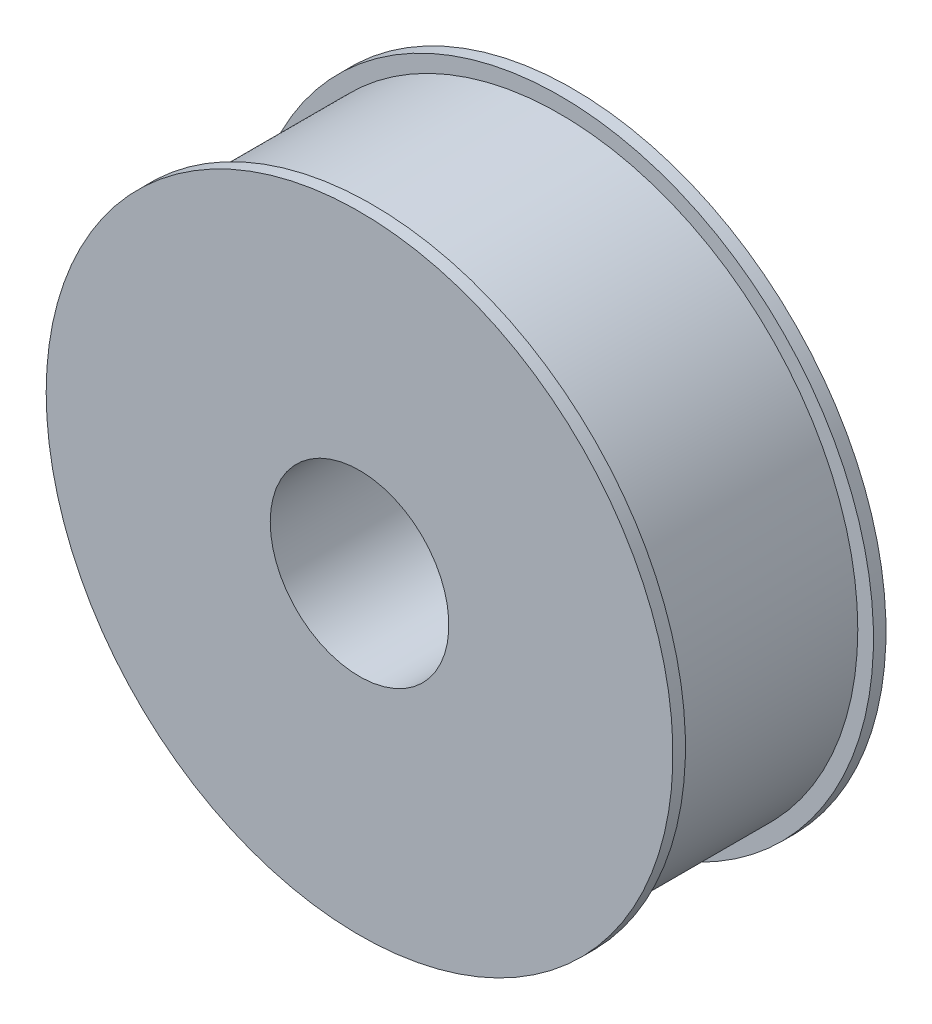
ISO-10303-21;
HEADER;
FILE_DESCRIPTION(('STEP AP214'),'2;1');
FILE_NAME('part.step','',(''),(''),'','','');
FILE_SCHEMA(('AUTOMOTIVE_DESIGN { 1 0 10303 214 1 1 1 1 }'));
ENDSEC;
DATA;
#1=APPLICATION_CONTEXT('core data for automotive mechanical design processes');
#2=APPLICATION_PROTOCOL_DEFINITION('international standard','automotive_design',2000,#1);
#3=PRODUCT_CONTEXT('',#1,'mechanical');
#4=PRODUCT('Part','Part','',(#3));
#5=PRODUCT_RELATED_PRODUCT_CATEGORY('part','',(#4));
#6=PRODUCT_DEFINITION_FORMATION('','',#4);
#7=PRODUCT_DEFINITION_CONTEXT('part definition',#1,'design');
#8=PRODUCT_DEFINITION('design','',#6,#7);
#9=PRODUCT_DEFINITION_SHAPE('','',#8);
#10=(LENGTH_UNIT() NAMED_UNIT(*) SI_UNIT(.MILLI.,.METRE.));
#11=(NAMED_UNIT(*) PLANE_ANGLE_UNIT() SI_UNIT($,.RADIAN.));
#12=(NAMED_UNIT(*) SI_UNIT($,.STERADIAN.) SOLID_ANGLE_UNIT());
#13=UNCERTAINTY_MEASURE_WITH_UNIT(LENGTH_MEASURE(1.E-05),#10,'distance_accuracy_value','');
#14=(GEOMETRIC_REPRESENTATION_CONTEXT(3) GLOBAL_UNCERTAINTY_ASSIGNED_CONTEXT((#13)) GLOBAL_UNIT_ASSIGNED_CONTEXT((#10,
#11,#12)) REPRESENTATION_CONTEXT('',''));
#15=CARTESIAN_POINT('',(0.,0.,0.));
#16=DIRECTION('',(0.,0.,1.));
#17=DIRECTION('',(1.,0.,0.));
#18=AXIS2_PLACEMENT_3D('',#15,#16,#17);
#19=CARTESIAN_POINT('',(100.,0.,34.));
#20=DIRECTION('',(0.,0.,1.));
#21=DIRECTION('',(1.,0.,0.));
#22=AXIS2_PLACEMENT_3D('',#19,#20,#21);
#23=PLANE('',#22);
#24=CARTESIAN_POINT('',(0.,0.,34.));
#25=DIRECTION('',(0.,0.,-1.));
#26=DIRECTION('',(-1.,0.,0.));
#27=AXIS2_PLACEMENT_3D('',#24,#25,#26);
#28=CIRCLE('',#27,28.5);
#29=CARTESIAN_POINT('',(-28.5,0.,34.));
#30=VERTEX_POINT('',#29);
#31=EDGE_CURVE('E10',#30,#30,#28,.T.);
#32=ORIENTED_EDGE('',*,*,#31,.T.);
#33=EDGE_LOOP('',(#32));
#34=FACE_BOUND('',#33,.T.);
#35=CARTESIAN_POINT('',(0.,0.,34.));
#36=DIRECTION('',(0.,0.,-1.));
#37=DIRECTION('',(-1.,0.,0.));
#38=AXIS2_PLACEMENT_3D('',#35,#36,#37);
#39=CIRCLE('',#38,100.);
#40=CARTESIAN_POINT('',(-100.,0.,34.));
#41=VERTEX_POINT('',#40);
#42=EDGE_CURVE('E63',#41,#41,#39,.T.);
#43=ORIENTED_EDGE('',*,*,#42,.F.);
#44=EDGE_LOOP('',(#43));
#45=FACE_BOUND('',#44,.T.);
#46=ADVANCED_FACE('F35',(#34,#45),#23,.T.);
#47=CARTESIAN_POINT('',(0.,0.,34.));
#48=DIRECTION('',(0.,0.,-1.));
#49=DIRECTION('',(-1.,0.,0.));
#50=AXIS2_PLACEMENT_3D('',#47,#48,#49);
#51=CYLINDRICAL_SURFACE('',#50,28.5);
#52=CARTESIAN_POINT('',(0.,0.,-34.));
#53=DIRECTION('',(0.,0.,-1.));
#54=DIRECTION('',(-1.,0.,0.));
#55=AXIS2_PLACEMENT_3D('',#52,#53,#54);
#56=CIRCLE('',#55,28.5);
#57=CARTESIAN_POINT('',(-28.5,0.,-34.));
#58=VERTEX_POINT('',#57);
#59=EDGE_CURVE('E41',#58,#58,#56,.T.);
#60=ORIENTED_EDGE('',*,*,#59,.T.);
#61=EDGE_LOOP('',(#60));
#62=FACE_BOUND('',#61,.T.);
#63=ORIENTED_EDGE('',*,*,#31,.F.);
#64=EDGE_LOOP('',(#63));
#65=FACE_BOUND('',#64,.T.);
#66=ADVANCED_FACE('F71',(#62,#65),#51,.F.);
#67=CARTESIAN_POINT('',(28.5,0.,-34.));
#68=DIRECTION('',(0.,0.,-1.));
#69=DIRECTION('',(-1.,0.,0.));
#70=AXIS2_PLACEMENT_3D('',#67,#68,#69);
#71=PLANE('',#70);
#72=CARTESIAN_POINT('',(0.,0.,-34.));
#73=DIRECTION('',(0.,0.,-1.));
#74=DIRECTION('',(-1.,0.,0.));
#75=AXIS2_PLACEMENT_3D('',#72,#73,#74);
#76=CIRCLE('',#75,100.);
#77=CARTESIAN_POINT('',(-100.,0.,-34.));
#78=VERTEX_POINT('',#77);
#79=EDGE_CURVE('E45',#78,#78,#76,.T.);
#80=ORIENTED_EDGE('',*,*,#79,.T.);
#81=EDGE_LOOP('',(#80));
#82=FACE_BOUND('',#81,.T.);
#83=ORIENTED_EDGE('',*,*,#59,.F.);
#84=EDGE_LOOP('',(#83));
#85=FACE_BOUND('',#84,.T.);
#86=ADVANCED_FACE('F75',(#82,#85),#71,.T.);
#87=CARTESIAN_POINT('',(0.,0.,34.));
#88=DIRECTION('',(0.,0.,-1.));
#89=DIRECTION('',(-1.,0.,0.));
#90=AXIS2_PLACEMENT_3D('',#87,#88,#89);
#91=CYLINDRICAL_SURFACE('',#90,100.);
#92=CARTESIAN_POINT('',(0.,0.,-30.));
#93=DIRECTION('',(0.,0.,-1.));
#94=DIRECTION('',(-1.,0.,0.));
#95=AXIS2_PLACEMENT_3D('',#92,#93,#94);
#96=CIRCLE('',#95,100.);
#97=CARTESIAN_POINT('',(-100.,0.,-30.));
#98=VERTEX_POINT('',#97);
#99=EDGE_CURVE('E49',#98,#98,#96,.T.);
#100=ORIENTED_EDGE('',*,*,#99,.T.);
#101=EDGE_LOOP('',(#100));
#102=FACE_BOUND('',#101,.T.);
#103=ORIENTED_EDGE('',*,*,#79,.F.);
#104=EDGE_LOOP('',(#103));
#105=FACE_BOUND('',#104,.T.);
#106=ADVANCED_FACE('F79',(#102,#105),#91,.T.);
#107=CARTESIAN_POINT('',(100.,0.,-30.));
#108=DIRECTION('',(0.,0.,1.));
#109=DIRECTION('',(1.,0.,0.));
#110=AXIS2_PLACEMENT_3D('',#107,#108,#109);
#111=PLANE('',#110);
#112=CARTESIAN_POINT('',(0.,0.,-30.));
#113=DIRECTION('',(0.,0.,-1.));
#114=DIRECTION('',(-1.,0.,0.));
#115=AXIS2_PLACEMENT_3D('',#112,#113,#114);
#116=CIRCLE('',#115,95.);
#117=CARTESIAN_POINT('',(-95.,0.,-30.));
#118=VERTEX_POINT('',#117);
#119=EDGE_CURVE('E54',#118,#118,#116,.T.);
#120=ORIENTED_EDGE('',*,*,#119,.T.);
#121=EDGE_LOOP('',(#120));
#122=FACE_BOUND('',#121,.T.);
#123=ORIENTED_EDGE('',*,*,#99,.F.);
#124=EDGE_LOOP('',(#123));
#125=FACE_BOUND('',#124,.T.);
#126=ADVANCED_FACE('F86',(#122,#125),#111,.T.);
#127=CARTESIAN_POINT('',(0.,0.,34.));
#128=DIRECTION('',(0.,0.,-1.));
#129=DIRECTION('',(-1.,0.,0.));
#130=AXIS2_PLACEMENT_3D('',#127,#128,#129);
#131=CYLINDRICAL_SURFACE('',#130,95.);
#132=CARTESIAN_POINT('',(0.,0.,30.));
#133=DIRECTION('',(0.,0.,-1.));
#134=DIRECTION('',(-1.,0.,0.));
#135=AXIS2_PLACEMENT_3D('',#132,#133,#134);
#136=CIRCLE('',#135,95.);
#137=CARTESIAN_POINT('',(-95.,0.,30.));
#138=VERTEX_POINT('',#137);
#139=EDGE_CURVE('E57',#138,#138,#136,.T.);
#140=ORIENTED_EDGE('',*,*,#139,.T.);
#141=EDGE_LOOP('',(#140));
#142=FACE_BOUND('',#141,.T.);
#143=ORIENTED_EDGE('',*,*,#119,.F.);
#144=EDGE_LOOP('',(#143));
#145=FACE_BOUND('',#144,.T.);
#146=ADVANCED_FACE('F90',(#142,#145),#131,.T.);
#147=CARTESIAN_POINT('',(95.,0.,30.));
#148=DIRECTION('',(0.,0.,-1.));
#149=DIRECTION('',(-1.,0.,0.));
#150=AXIS2_PLACEMENT_3D('',#147,#148,#149);
#151=PLANE('',#150);
#152=CARTESIAN_POINT('',(0.,0.,30.));
#153=DIRECTION('',(0.,0.,-1.));
#154=DIRECTION('',(-1.,0.,0.));
#155=AXIS2_PLACEMENT_3D('',#152,#153,#154);
#156=CIRCLE('',#155,100.);
#157=CARTESIAN_POINT('',(-100.,0.,30.));
#158=VERTEX_POINT('',#157);
#159=EDGE_CURVE('E60',#158,#158,#156,.T.);
#160=ORIENTED_EDGE('',*,*,#159,.T.);
#161=EDGE_LOOP('',(#160));
#162=FACE_BOUND('',#161,.T.);
#163=ORIENTED_EDGE('',*,*,#139,.F.);
#164=EDGE_LOOP('',(#163));
#165=FACE_BOUND('',#164,.T.);
#166=ADVANCED_FACE('F94',(#162,#165),#151,.T.);
#167=CARTESIAN_POINT('',(0.,0.,34.));
#168=DIRECTION('',(0.,0.,-1.));
#169=DIRECTION('',(-1.,0.,0.));
#170=AXIS2_PLACEMENT_3D('',#167,#168,#169);
#171=CYLINDRICAL_SURFACE('',#170,100.);
#172=ORIENTED_EDGE('',*,*,#42,.T.);
#173=EDGE_LOOP('',(#172));
#174=FACE_BOUND('',#173,.T.);
#175=ORIENTED_EDGE('',*,*,#159,.F.);
#176=EDGE_LOOP('',(#175));
#177=FACE_BOUND('',#176,.T.);
#178=ADVANCED_FACE('F67',(#174,#177),#171,.T.);
#179=CLOSED_SHELL('',(#46,#66,#86,#106,#126,#146,#166,#178));
#180=MANIFOLD_SOLID_BREP('B2',#179);
#181=ADVANCED_BREP_SHAPE_REPRESENTATION('',(#18,#180),#14);
#182=SHAPE_DEFINITION_REPRESENTATION(#9,#181);
ENDSEC;
END-ISO-10303-21;
